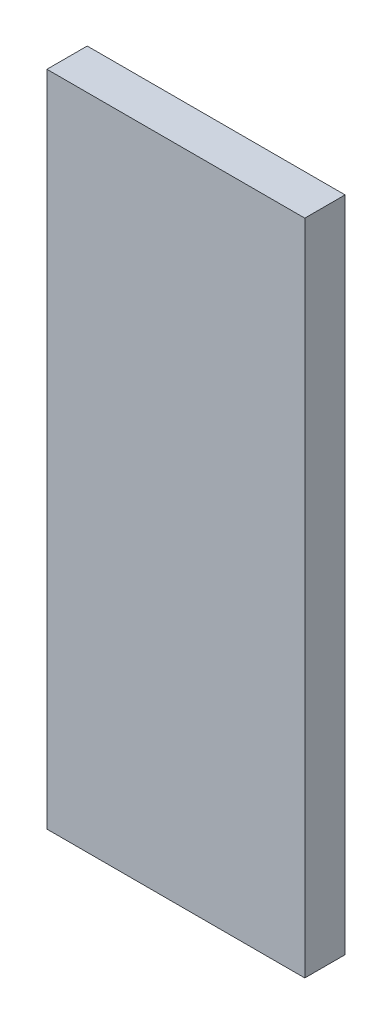
ISO-10303-21;
HEADER;
FILE_DESCRIPTION(('STEP AP214'),'2;1');
FILE_NAME('part.step','',(''),(''),'','','');
FILE_SCHEMA(('AUTOMOTIVE_DESIGN { 1 0 10303 214 1 1 1 1 }'));
ENDSEC;
DATA;
#1=APPLICATION_CONTEXT('core data for automotive mechanical design processes');
#2=APPLICATION_PROTOCOL_DEFINITION('international standard','automotive_design',2000,#1);
#3=PRODUCT_CONTEXT('',#1,'mechanical');
#4=PRODUCT('Part','Part','',(#3));
#5=PRODUCT_RELATED_PRODUCT_CATEGORY('part','',(#4));
#6=PRODUCT_DEFINITION_FORMATION('','',#4);
#7=PRODUCT_DEFINITION_CONTEXT('part definition',#1,'design');
#8=PRODUCT_DEFINITION('design','',#6,#7);
#9=PRODUCT_DEFINITION_SHAPE('','',#8);
#10=(LENGTH_UNIT() NAMED_UNIT(*) SI_UNIT(.MILLI.,.METRE.));
#11=(NAMED_UNIT(*) PLANE_ANGLE_UNIT() SI_UNIT($,.RADIAN.));
#12=(NAMED_UNIT(*) SI_UNIT($,.STERADIAN.) SOLID_ANGLE_UNIT());
#13=UNCERTAINTY_MEASURE_WITH_UNIT(LENGTH_MEASURE(1.E-05),#10,'distance_accuracy_value','');
#14=(GEOMETRIC_REPRESENTATION_CONTEXT(3) GLOBAL_UNCERTAINTY_ASSIGNED_CONTEXT((#13)) GLOBAL_UNIT_ASSIGNED_CONTEXT((#10,
#11,#12)) REPRESENTATION_CONTEXT('',''));
#15=CARTESIAN_POINT('',(0.,0.,0.));
#16=DIRECTION('',(0.,0.,1.));
#17=DIRECTION('',(1.,0.,0.));
#18=AXIS2_PLACEMENT_3D('',#15,#16,#17);
#19=CARTESIAN_POINT('',(48.,245.,7.5));
#20=DIRECTION('',(-1.,0.,0.));
#21=DIRECTION('',(0.,0.,1.));
#22=AXIS2_PLACEMENT_3D('',#19,#20,#21);
#23=PLANE('',#22);
#24=DIRECTION('',(0.,0.,-1.));
#25=VECTOR('',#24,1.);
#26=CARTESIAN_POINT('',(48.,0.,7.5));
#27=LINE('',#26,#25);
#28=CARTESIAN_POINT('',(48.,0.,7.5));
#29=VERTEX_POINT('',#28);
#30=CARTESIAN_POINT('',(48.,0.,-7.5));
#31=VERTEX_POINT('',#30);
#32=EDGE_CURVE('E96',#29,#31,#27,.T.);
#33=ORIENTED_EDGE('',*,*,#32,.T.);
#34=DIRECTION('',(0.,-1.,0.));
#35=VECTOR('',#34,1.);
#36=CARTESIAN_POINT('',(48.,245.,-7.5));
#37=LINE('',#36,#35);
#38=CARTESIAN_POINT('',(48.,245.,-7.5));
#39=VERTEX_POINT('',#38);
#40=EDGE_CURVE('E11',#39,#31,#37,.T.);
#41=ORIENTED_EDGE('',*,*,#40,.F.);
#42=DIRECTION('',(0.,0.,-1.));
#43=VECTOR('',#42,1.);
#44=CARTESIAN_POINT('',(48.,245.,7.5));
#45=LINE('',#44,#43);
#46=CARTESIAN_POINT('',(48.,245.,7.5));
#47=VERTEX_POINT('',#46);
#48=EDGE_CURVE('E84',#47,#39,#45,.T.);
#49=ORIENTED_EDGE('',*,*,#48,.F.);
#50=DIRECTION('',(0.,-1.,0.));
#51=VECTOR('',#50,1.);
#52=CARTESIAN_POINT('',(48.,245.,7.5));
#53=LINE('',#52,#51);
#54=EDGE_CURVE('E92',#47,#29,#53,.T.);
#55=ORIENTED_EDGE('',*,*,#54,.T.);
#56=EDGE_LOOP('',(#33,#41,#49,#55));
#57=FACE_BOUND('',#56,.T.);
#58=ADVANCED_FACE('F33',(#57),#23,.F.);
#59=CARTESIAN_POINT('',(-48.,245.,-7.5));
#60=DIRECTION('',(0.,0.,1.));
#61=DIRECTION('',(1.,0.,0.));
#62=AXIS2_PLACEMENT_3D('',#59,#60,#61);
#63=PLANE('',#62);
#64=DIRECTION('',(-1.,0.,0.));
#65=VECTOR('',#64,1.);
#66=CARTESIAN_POINT('',(-48.,0.,-7.5));
#67=LINE('',#66,#65);
#68=CARTESIAN_POINT('',(-48.,0.,-7.5));
#69=VERTEX_POINT('',#68);
#70=EDGE_CURVE('E88',#31,#69,#67,.T.);
#71=ORIENTED_EDGE('',*,*,#70,.T.);
#72=DIRECTION('',(0.,-1.,0.));
#73=VECTOR('',#72,1.);
#74=CARTESIAN_POINT('',(-48.,245.,-7.5));
#75=LINE('',#74,#73);
#76=CARTESIAN_POINT('',(-48.,245.,-7.5));
#77=VERTEX_POINT('',#76);
#78=EDGE_CURVE('E41',#77,#69,#75,.T.);
#79=ORIENTED_EDGE('',*,*,#78,.F.);
#80=DIRECTION('',(-1.,0.,0.));
#81=VECTOR('',#80,1.);
#82=CARTESIAN_POINT('',(-48.,245.,-7.5));
#83=LINE('',#82,#81);
#84=EDGE_CURVE('E79',#39,#77,#83,.T.);
#85=ORIENTED_EDGE('',*,*,#84,.F.);
#86=ORIENTED_EDGE('',*,*,#40,.T.);
#87=EDGE_LOOP('',(#71,#79,#85,#86));
#88=FACE_BOUND('',#87,.T.);
#89=ADVANCED_FACE('F87',(#88),#63,.F.);
#90=CARTESIAN_POINT('',(-48.,245.,7.5));
#91=DIRECTION('',(1.,0.,0.));
#92=DIRECTION('',(0.,0.,-1.));
#93=AXIS2_PLACEMENT_3D('',#90,#91,#92);
#94=PLANE('',#93);
#95=DIRECTION('',(0.,0.,1.));
#96=VECTOR('',#95,1.);
#97=CARTESIAN_POINT('',(-48.,0.,7.5));
#98=LINE('',#97,#96);
#99=CARTESIAN_POINT('',(-48.,0.,7.5));
#100=VERTEX_POINT('',#99);
#101=EDGE_CURVE('E66',#69,#100,#98,.T.);
#102=ORIENTED_EDGE('',*,*,#101,.T.);
#103=DIRECTION('',(0.,-1.,0.));
#104=VECTOR('',#103,1.);
#105=CARTESIAN_POINT('',(-48.,245.,7.5));
#106=LINE('',#105,#104);
#107=CARTESIAN_POINT('',(-48.,245.,7.5));
#108=VERTEX_POINT('',#107);
#109=EDGE_CURVE('E89',#108,#100,#106,.T.);
#110=ORIENTED_EDGE('',*,*,#109,.F.);
#111=DIRECTION('',(0.,0.,1.));
#112=VECTOR('',#111,1.);
#113=CARTESIAN_POINT('',(-48.,245.,7.5));
#114=LINE('',#113,#112);
#115=EDGE_CURVE('E82',#77,#108,#114,.T.);
#116=ORIENTED_EDGE('',*,*,#115,.F.);
#117=ORIENTED_EDGE('',*,*,#78,.T.);
#118=EDGE_LOOP('',(#102,#110,#116,#117));
#119=FACE_BOUND('',#118,.T.);
#120=ADVANCED_FACE('F90',(#119),#94,.F.);
#121=CARTESIAN_POINT('',(-48.,245.,7.5));
#122=DIRECTION('',(0.,0.,-1.));
#123=DIRECTION('',(-1.,0.,0.));
#124=AXIS2_PLACEMENT_3D('',#121,#122,#123);
#125=PLANE('',#124);
#126=DIRECTION('',(1.,0.,0.));
#127=VECTOR('',#126,1.);
#128=CARTESIAN_POINT('',(-48.,0.,7.5));
#129=LINE('',#128,#127);
#130=EDGE_CURVE('E72',#100,#29,#129,.T.);
#131=ORIENTED_EDGE('',*,*,#130,.T.);
#132=ORIENTED_EDGE('',*,*,#54,.F.);
#133=DIRECTION('',(1.,0.,0.));
#134=VECTOR('',#133,1.);
#135=CARTESIAN_POINT('',(-48.,245.,7.5));
#136=LINE('',#135,#134);
#137=EDGE_CURVE('E49',#108,#47,#136,.T.);
#138=ORIENTED_EDGE('',*,*,#137,.F.);
#139=ORIENTED_EDGE('',*,*,#109,.T.);
#140=EDGE_LOOP('',(#131,#132,#138,#139));
#141=FACE_BOUND('',#140,.T.);
#142=ADVANCED_FACE('F103',(#141),#125,.F.);
#143=CARTESIAN_POINT('',(0.,245.,0.));
#144=DIRECTION('',(0.,-1.,0.));
#145=DIRECTION('',(0.,0.,-1.));
#146=AXIS2_PLACEMENT_3D('',#143,#144,#145);
#147=PLANE('',#146);
#148=ORIENTED_EDGE('',*,*,#48,.T.);
#149=ORIENTED_EDGE('',*,*,#84,.T.);
#150=ORIENTED_EDGE('',*,*,#115,.T.);
#151=ORIENTED_EDGE('',*,*,#137,.T.);
#152=EDGE_LOOP('',(#148,#149,#150,#151));
#153=FACE_BOUND('',#152,.T.);
#154=ADVANCED_FACE('F80',(#153),#147,.F.);
#155=CARTESIAN_POINT('',(0.,0.,0.));
#156=DIRECTION('',(0.,-1.,0.));
#157=DIRECTION('',(0.,0.,-1.));
#158=AXIS2_PLACEMENT_3D('',#155,#156,#157);
#159=PLANE('',#158);
#160=ORIENTED_EDGE('',*,*,#32,.F.);
#161=ORIENTED_EDGE('',*,*,#130,.F.);
#162=ORIENTED_EDGE('',*,*,#101,.F.);
#163=ORIENTED_EDGE('',*,*,#70,.F.);
#164=EDGE_LOOP('',(#160,#161,#162,#163));
#165=FACE_BOUND('',#164,.T.);
#166=ADVANCED_FACE('F106',(#165),#159,.T.);
#167=CLOSED_SHELL('',(#58,#89,#120,#142,#154,#166));
#168=MANIFOLD_SOLID_BREP('B2',#167);
#169=ADVANCED_BREP_SHAPE_REPRESENTATION('',(#18,#168),#14);
#170=SHAPE_DEFINITION_REPRESENTATION(#9,#169);
ENDSEC;
END-ISO-10303-21;
